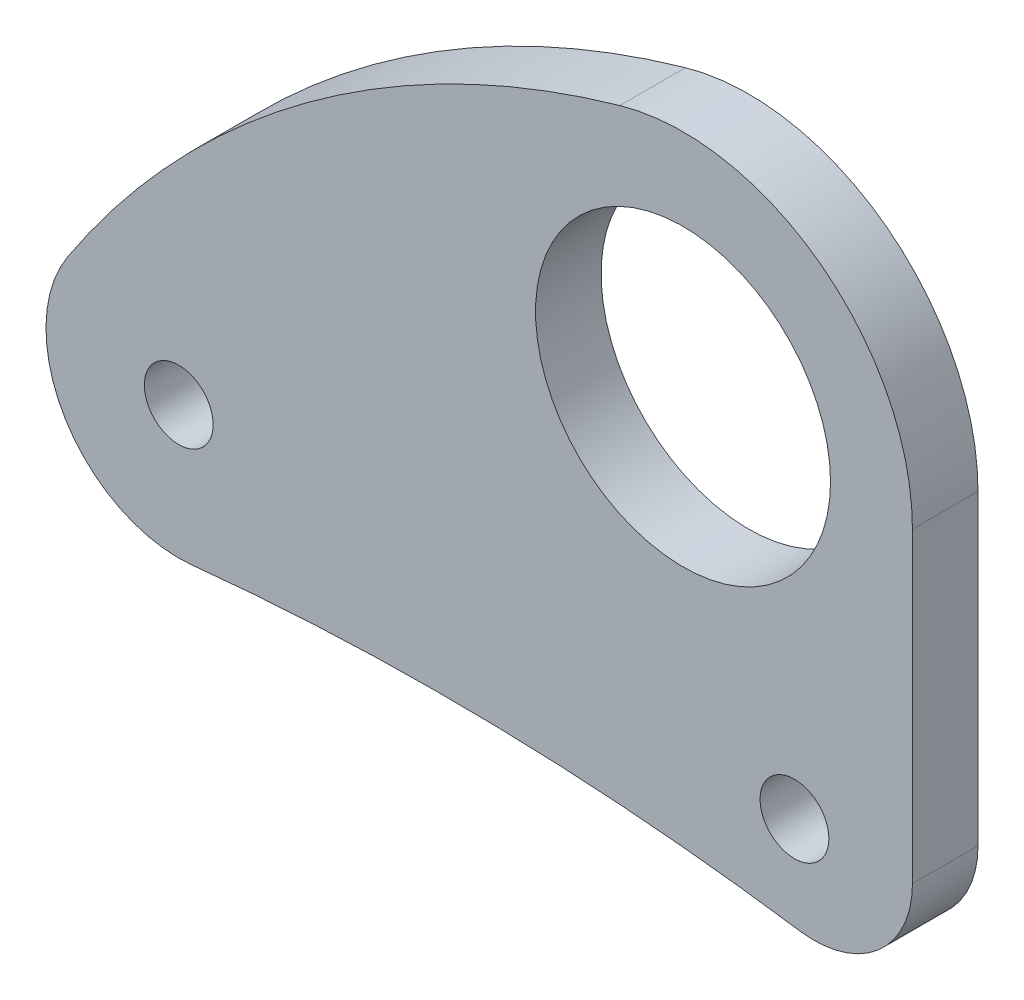
ISO-10303-21;
HEADER;
FILE_DESCRIPTION(('STEP AP214'),'2;1');
FILE_NAME('part.step','',(''),(''),'','','');
FILE_SCHEMA(('AUTOMOTIVE_DESIGN { 1 0 10303 214 1 1 1 1 }'));
ENDSEC;
DATA;
#1=APPLICATION_CONTEXT('core data for automotive mechanical design processes');
#2=APPLICATION_PROTOCOL_DEFINITION('international standard','automotive_design',2000,#1);
#3=PRODUCT_CONTEXT('',#1,'mechanical');
#4=PRODUCT('Part','Part','',(#3));
#5=PRODUCT_RELATED_PRODUCT_CATEGORY('part','',(#4));
#6=PRODUCT_DEFINITION_FORMATION('','',#4);
#7=PRODUCT_DEFINITION_CONTEXT('part definition',#1,'design');
#8=PRODUCT_DEFINITION('design','',#6,#7);
#9=PRODUCT_DEFINITION_SHAPE('','',#8);
#10=(LENGTH_UNIT() NAMED_UNIT(*) SI_UNIT(.MILLI.,.METRE.));
#11=(NAMED_UNIT(*) PLANE_ANGLE_UNIT() SI_UNIT($,.RADIAN.));
#12=(NAMED_UNIT(*) SI_UNIT($,.STERADIAN.) SOLID_ANGLE_UNIT());
#13=UNCERTAINTY_MEASURE_WITH_UNIT(LENGTH_MEASURE(1.E-05),#10,'distance_accuracy_value','');
#14=(GEOMETRIC_REPRESENTATION_CONTEXT(3) GLOBAL_UNCERTAINTY_ASSIGNED_CONTEXT((#13)) GLOBAL_UNIT_ASSIGNED_CONTEXT((#10,
#11,#12)) REPRESENTATION_CONTEXT('',''));
#15=CARTESIAN_POINT('',(0.,0.,0.));
#16=DIRECTION('',(0.,0.,1.));
#17=DIRECTION('',(1.,0.,0.));
#18=AXIS2_PLACEMENT_3D('',#15,#16,#17);
#19=CARTESIAN_POINT('',(0.,0.,4.));
#20=DIRECTION('',(0.,0.,1.));
#21=DIRECTION('',(1.,0.,0.));
#22=AXIS2_PLACEMENT_3D('',#19,#20,#21);
#23=PLANE('',#22);
#24=CARTESIAN_POINT('',(6.8,-18.9148090130458,4.));
#25=DIRECTION('',(0.,0.,1.));
#26=DIRECTION('',(1.,0.,0.));
#27=AXIS2_PLACEMENT_3D('',#24,#25,#26);
#28=CIRCLE('',#27,2.1);
#29=CARTESIAN_POINT('',(8.9,-18.9148090130458,4.));
#30=VERTEX_POINT('',#29);
#31=EDGE_CURVE('E188',#30,#30,#28,.T.);
#32=ORIENTED_EDGE('',*,*,#31,.F.);
#33=EDGE_LOOP('',(#32));
#34=FACE_BOUND('',#33,.T.);
#35=CARTESIAN_POINT('',(0.,0.,4.));
#36=DIRECTION('',(0.,0.,1.));
#37=DIRECTION('',(1.,0.,0.));
#38=AXIS2_PLACEMENT_3D('',#35,#36,#37);
#39=CIRCLE('',#38,14.);
#40=CARTESIAN_POINT('',(14.,0.,4.));
#41=VERTEX_POINT('',#40);
#42=CARTESIAN_POINT('',(-3.85451366304862,13.4589273131766,4.));
#43=VERTEX_POINT('',#42);
#44=EDGE_CURVE('E133',#41,#43,#39,.T.);
#45=ORIENTED_EDGE('',*,*,#44,.T.);
#46=CARTESIAN_POINT('',(12.6648306071598,-44.2221897432946,4.));
#47=DIRECTION('',(0.,0.,1.));
#48=DIRECTION('',(1.,0.,0.));
#49=AXIS2_PLACEMENT_3D('',#46,#47,#48);
#50=CIRCLE('',#49,60.);
#51=CARTESIAN_POINT('',(-37.5518403068304,-11.3849249011063,4.));
#52=VERTEX_POINT('',#51);
#53=EDGE_CURVE('E91',#43,#52,#50,.T.);
#54=ORIENTED_EDGE('',*,*,#53,.T.);
#55=CARTESIAN_POINT('',(-30.7725897334418,-15.8179556548018,4.));
#56=DIRECTION('',(0.,0.,1.));
#57=DIRECTION('',(1.,0.,0.));
#58=AXIS2_PLACEMENT_3D('',#55,#56,#57);
#59=CIRCLE('',#58,8.1);
#60=CARTESIAN_POINT('',(-29.9442973212136,-23.8754944651237,4.));
#61=VERTEX_POINT('',#60);
#62=EDGE_CURVE('E104',#52,#61,#59,.T.);
#63=ORIENTED_EDGE('',*,*,#62,.T.);
#64=CARTESIAN_POINT('',(-14.6055489466185,-173.089176137753,4.));
#65=DIRECTION('',(0.,0.,-1.));
#66=DIRECTION('',(-1.,0.,0.));
#67=AXIS2_PLACEMENT_3D('',#64,#65,#66);
#68=CIRCLE('',#67,150.);
#69=CARTESIAN_POINT('',(7.13055580974545,-24.6723922148413,4.));
#70=VERTEX_POINT('',#69);
#71=EDGE_CURVE('E98',#61,#70,#68,.T.);
#72=ORIENTED_EDGE('',*,*,#71,.T.);
#73=CARTESIAN_POINT('',(8.,-18.7357208579248,4.));
#74=DIRECTION('',(0.,0.,1.));
#75=DIRECTION('',(-1.,0.,0.));
#76=AXIS2_PLACEMENT_3D('',#73,#74,#75);
#77=CIRCLE('',#76,5.99999999999999);
#78=CARTESIAN_POINT('',(14.,-18.7357208579248,4.));
#79=VERTEX_POINT('',#78);
#80=EDGE_CURVE('E102',#70,#79,#77,.T.);
#81=ORIENTED_EDGE('',*,*,#80,.T.);
#82=DIRECTION('',(0.,1.,0.));
#83=VECTOR('',#82,1.);
#84=CARTESIAN_POINT('',(14.,0.,4.));
#85=LINE('',#84,#83);
#86=EDGE_CURVE('E54',#79,#41,#85,.T.);
#87=ORIENTED_EDGE('',*,*,#86,.T.);
#88=EDGE_LOOP('',(#45,#54,#63,#72,#81,#87));
#89=FACE_BOUND('',#88,.T.);
#90=CARTESIAN_POINT('',(0.,0.,4.));
#91=DIRECTION('',(0.,0.,1.));
#92=DIRECTION('',(1.,0.,0.));
#93=AXIS2_PLACEMENT_3D('',#90,#91,#92);
#94=CIRCLE('',#93,9.);
#95=CARTESIAN_POINT('',(9.,0.,4.));
#96=VERTEX_POINT('',#95);
#97=EDGE_CURVE('E126',#96,#96,#94,.T.);
#98=ORIENTED_EDGE('',*,*,#97,.F.);
#99=EDGE_LOOP('',(#98));
#100=FACE_BOUND('',#99,.T.);
#101=CARTESIAN_POINT('',(-30.7725897334418,-15.8179556548018,4.));
#102=DIRECTION('',(0.,0.,1.));
#103=DIRECTION('',(1.,0.,0.));
#104=AXIS2_PLACEMENT_3D('',#101,#102,#103);
#105=CIRCLE('',#104,2.1);
#106=CARTESIAN_POINT('',(-28.6725897334418,-15.8179556548018,4.));
#107=VERTEX_POINT('',#106);
#108=EDGE_CURVE('E179',#107,#107,#105,.T.);
#109=ORIENTED_EDGE('',*,*,#108,.F.);
#110=EDGE_LOOP('',(#109));
#111=FACE_BOUND('',#110,.T.);
#112=ADVANCED_FACE('F37',(#34,#89,#100,#111),#23,.T.);
#113=CARTESIAN_POINT('',(0.,0.,0.));
#114=DIRECTION('',(0.,0.,1.));
#115=DIRECTION('',(1.,0.,0.));
#116=AXIS2_PLACEMENT_3D('',#113,#114,#115);
#117=PLANE('',#116);
#118=CARTESIAN_POINT('',(0.,0.,0.));
#119=DIRECTION('',(0.,0.,1.));
#120=DIRECTION('',(1.,0.,0.));
#121=AXIS2_PLACEMENT_3D('',#118,#119,#120);
#122=CIRCLE('',#121,14.);
#123=CARTESIAN_POINT('',(14.,0.,0.));
#124=VERTEX_POINT('',#123);
#125=CARTESIAN_POINT('',(-3.85451366304862,13.4589273131766,0.));
#126=VERTEX_POINT('',#125);
#127=EDGE_CURVE('E122',#124,#126,#122,.T.);
#128=ORIENTED_EDGE('',*,*,#127,.F.);
#129=DIRECTION('',(0.,1.,0.));
#130=VECTOR('',#129,1.);
#131=CARTESIAN_POINT('',(14.,0.,0.));
#132=LINE('',#131,#130);
#133=CARTESIAN_POINT('',(14.,-18.7357208579248,0.));
#134=VERTEX_POINT('',#133);
#135=EDGE_CURVE('E83',#134,#124,#132,.T.);
#136=ORIENTED_EDGE('',*,*,#135,.F.);
#137=CARTESIAN_POINT('',(8.,-18.7357208579248,0.));
#138=DIRECTION('',(0.,0.,1.));
#139=DIRECTION('',(-1.,0.,0.));
#140=AXIS2_PLACEMENT_3D('',#137,#138,#139);
#141=CIRCLE('',#140,5.99999999999999);
#142=CARTESIAN_POINT('',(7.13055580974545,-24.6723922148413,0.));
#143=VERTEX_POINT('',#142);
#144=EDGE_CURVE('E77',#143,#134,#141,.T.);
#145=ORIENTED_EDGE('',*,*,#144,.F.);
#146=CARTESIAN_POINT('',(-14.6055489466185,-173.089176137753,0.));
#147=DIRECTION('',(0.,0.,-1.));
#148=DIRECTION('',(-1.,0.,0.));
#149=AXIS2_PLACEMENT_3D('',#146,#147,#148);
#150=CIRCLE('',#149,150.);
#151=CARTESIAN_POINT('',(-29.9442973212136,-23.8754944651237,0.));
#152=VERTEX_POINT('',#151);
#153=EDGE_CURVE('E112',#152,#143,#150,.T.);
#154=ORIENTED_EDGE('',*,*,#153,.F.);
#155=CARTESIAN_POINT('',(-30.7725897334418,-15.8179556548018,0.));
#156=DIRECTION('',(0.,0.,1.));
#157=DIRECTION('',(1.,0.,0.));
#158=AXIS2_PLACEMENT_3D('',#155,#156,#157);
#159=CIRCLE('',#158,8.1);
#160=CARTESIAN_POINT('',(-37.5518403068304,-11.3849249011063,0.));
#161=VERTEX_POINT('',#160);
#162=EDGE_CURVE('E128',#161,#152,#159,.T.);
#163=ORIENTED_EDGE('',*,*,#162,.F.);
#164=CARTESIAN_POINT('',(12.6648306071598,-44.2221897432946,0.));
#165=DIRECTION('',(0.,0.,1.));
#166=DIRECTION('',(1.,0.,0.));
#167=AXIS2_PLACEMENT_3D('',#164,#165,#166);
#168=CIRCLE('',#167,60.);
#169=EDGE_CURVE('E125',#126,#161,#168,.T.);
#170=ORIENTED_EDGE('',*,*,#169,.F.);
#171=EDGE_LOOP('',(#128,#136,#145,#154,#163,#170));
#172=FACE_BOUND('',#171,.T.);
#173=CARTESIAN_POINT('',(0.,0.,0.));
#174=DIRECTION('',(0.,0.,1.));
#175=DIRECTION('',(1.,0.,0.));
#176=AXIS2_PLACEMENT_3D('',#173,#174,#175);
#177=CIRCLE('',#176,9.);
#178=CARTESIAN_POINT('',(9.,0.,0.));
#179=VERTEX_POINT('',#178);
#180=EDGE_CURVE('E191',#179,#179,#177,.T.);
#181=ORIENTED_EDGE('',*,*,#180,.T.);
#182=EDGE_LOOP('',(#181));
#183=FACE_BOUND('',#182,.T.);
#184=CARTESIAN_POINT('',(6.8,-18.9148090130458,0.));
#185=DIRECTION('',(0.,0.,1.));
#186=DIRECTION('',(1.,0.,0.));
#187=AXIS2_PLACEMENT_3D('',#184,#185,#186);
#188=CIRCLE('',#187,2.1);
#189=CARTESIAN_POINT('',(8.9,-18.9148090130458,0.));
#190=VERTEX_POINT('',#189);
#191=EDGE_CURVE('E185',#190,#190,#188,.T.);
#192=ORIENTED_EDGE('',*,*,#191,.T.);
#193=EDGE_LOOP('',(#192));
#194=FACE_BOUND('',#193,.T.);
#195=CARTESIAN_POINT('',(-30.7725897334418,-15.8179556548018,0.));
#196=DIRECTION('',(0.,0.,1.));
#197=DIRECTION('',(1.,0.,0.));
#198=AXIS2_PLACEMENT_3D('',#195,#196,#197);
#199=CIRCLE('',#198,2.1);
#200=CARTESIAN_POINT('',(-28.6725897334418,-15.8179556548018,0.));
#201=VERTEX_POINT('',#200);
#202=EDGE_CURVE('E182',#201,#201,#199,.T.);
#203=ORIENTED_EDGE('',*,*,#202,.T.);
#204=EDGE_LOOP('',(#203));
#205=FACE_BOUND('',#204,.T.);
#206=ADVANCED_FACE('F142',(#172,#183,#194,#205),#117,.F.);
#207=CARTESIAN_POINT('',(0.,0.,4.));
#208=DIRECTION('',(0.,0.,-1.));
#209=DIRECTION('',(-1.,0.,0.));
#210=AXIS2_PLACEMENT_3D('',#207,#208,#209);
#211=CYLINDRICAL_SURFACE('',#210,14.);
#212=ORIENTED_EDGE('',*,*,#127,.T.);
#213=DIRECTION('',(0.,0.,-1.));
#214=VECTOR('',#213,1.);
#215=CARTESIAN_POINT('',(-3.85451366304862,13.4589273131766,4.));
#216=LINE('',#215,#214);
#217=EDGE_CURVE('E11',#43,#126,#216,.T.);
#218=ORIENTED_EDGE('',*,*,#217,.F.);
#219=ORIENTED_EDGE('',*,*,#44,.F.);
#220=DIRECTION('',(0.,0.,-1.));
#221=VECTOR('',#220,1.);
#222=CARTESIAN_POINT('',(14.,0.,4.));
#223=LINE('',#222,#221);
#224=EDGE_CURVE('E118',#41,#124,#223,.T.);
#225=ORIENTED_EDGE('',*,*,#224,.T.);
#226=EDGE_LOOP('',(#212,#218,#219,#225));
#227=FACE_BOUND('',#226,.T.);
#228=ADVANCED_FACE('F39',(#227),#211,.T.);
#229=CARTESIAN_POINT('',(12.6648306071598,-44.2221897432946,4.));
#230=DIRECTION('',(0.,0.,-1.));
#231=DIRECTION('',(-1.,0.,0.));
#232=AXIS2_PLACEMENT_3D('',#229,#230,#231);
#233=CYLINDRICAL_SURFACE('',#232,60.);
#234=ORIENTED_EDGE('',*,*,#169,.T.);
#235=DIRECTION('',(0.,0.,-1.));
#236=VECTOR('',#235,1.);
#237=CARTESIAN_POINT('',(-37.5518403068304,-11.3849249011063,4.));
#238=LINE('',#237,#236);
#239=EDGE_CURVE('E46',#52,#161,#238,.T.);
#240=ORIENTED_EDGE('',*,*,#239,.F.);
#241=ORIENTED_EDGE('',*,*,#53,.F.);
#242=ORIENTED_EDGE('',*,*,#217,.T.);
#243=EDGE_LOOP('',(#234,#240,#241,#242));
#244=FACE_BOUND('',#243,.T.);
#245=ADVANCED_FACE('F241',(#244),#233,.T.);
#246=CARTESIAN_POINT('',(-30.7725897334418,-15.8179556548018,4.));
#247=DIRECTION('',(0.,0.,-1.));
#248=DIRECTION('',(-1.,0.,0.));
#249=AXIS2_PLACEMENT_3D('',#246,#247,#248);
#250=CYLINDRICAL_SURFACE('',#249,8.1);
#251=ORIENTED_EDGE('',*,*,#162,.T.);
#252=DIRECTION('',(0.,0.,-1.));
#253=VECTOR('',#252,1.);
#254=CARTESIAN_POINT('',(-29.9442973212136,-23.8754944651237,4.));
#255=LINE('',#254,#253);
#256=EDGE_CURVE('E113',#61,#152,#255,.T.);
#257=ORIENTED_EDGE('',*,*,#256,.F.);
#258=ORIENTED_EDGE('',*,*,#62,.F.);
#259=ORIENTED_EDGE('',*,*,#239,.T.);
#260=EDGE_LOOP('',(#251,#257,#258,#259));
#261=FACE_BOUND('',#260,.T.);
#262=ADVANCED_FACE('F139',(#261),#250,.T.);
#263=CARTESIAN_POINT('',(-14.6055489466185,-173.089176137753,4.));
#264=DIRECTION('',(0.,0.,-1.));
#265=DIRECTION('',(-1.,0.,0.));
#266=AXIS2_PLACEMENT_3D('',#263,#264,#265);
#267=CYLINDRICAL_SURFACE('',#266,150.);
#268=ORIENTED_EDGE('',*,*,#153,.T.);
#269=DIRECTION('',(0.,0.,-1.));
#270=VECTOR('',#269,1.);
#271=CARTESIAN_POINT('',(7.13055580974545,-24.6723922148413,4.));
#272=LINE('',#271,#270);
#273=EDGE_CURVE('E109',#70,#143,#272,.T.);
#274=ORIENTED_EDGE('',*,*,#273,.F.);
#275=ORIENTED_EDGE('',*,*,#71,.F.);
#276=ORIENTED_EDGE('',*,*,#256,.T.);
#277=EDGE_LOOP('',(#268,#274,#275,#276));
#278=FACE_BOUND('',#277,.T.);
#279=ADVANCED_FACE('F110',(#278),#267,.F.);
#280=CARTESIAN_POINT('',(8.,-18.7357208579248,4.));
#281=DIRECTION('',(0.,0.,-1.));
#282=DIRECTION('',(-1.,0.,0.));
#283=AXIS2_PLACEMENT_3D('',#280,#281,#282);
#284=CYLINDRICAL_SURFACE('',#283,5.99999999999999);
#285=ORIENTED_EDGE('',*,*,#144,.T.);
#286=DIRECTION('',(0.,0.,-1.));
#287=VECTOR('',#286,1.);
#288=CARTESIAN_POINT('',(14.,-18.7357208579248,4.));
#289=LINE('',#288,#287);
#290=EDGE_CURVE('E114',#79,#134,#289,.T.);
#291=ORIENTED_EDGE('',*,*,#290,.F.);
#292=ORIENTED_EDGE('',*,*,#80,.F.);
#293=ORIENTED_EDGE('',*,*,#273,.T.);
#294=EDGE_LOOP('',(#285,#291,#292,#293));
#295=FACE_BOUND('',#294,.T.);
#296=ADVANCED_FACE('F116',(#295),#284,.T.);
#297=CARTESIAN_POINT('',(14.,0.,4.));
#298=DIRECTION('',(-1.,0.,0.));
#299=DIRECTION('',(0.,0.,1.));
#300=AXIS2_PLACEMENT_3D('',#297,#298,#299);
#301=PLANE('',#300);
#302=ORIENTED_EDGE('',*,*,#135,.T.);
#303=ORIENTED_EDGE('',*,*,#224,.F.);
#304=ORIENTED_EDGE('',*,*,#86,.F.);
#305=ORIENTED_EDGE('',*,*,#290,.T.);
#306=EDGE_LOOP('',(#302,#303,#304,#305));
#307=FACE_BOUND('',#306,.T.);
#308=ADVANCED_FACE('F147',(#307),#301,.F.);
#309=CARTESIAN_POINT('',(0.,0.,4.));
#310=DIRECTION('',(0.,0.,-1.));
#311=DIRECTION('',(-1.,0.,0.));
#312=AXIS2_PLACEMENT_3D('',#309,#310,#311);
#313=CYLINDRICAL_SURFACE('',#312,9.);
#314=ORIENTED_EDGE('',*,*,#97,.T.);
#315=EDGE_LOOP('',(#314));
#316=FACE_BOUND('',#315,.T.);
#317=ORIENTED_EDGE('',*,*,#180,.F.);
#318=EDGE_LOOP('',(#317));
#319=FACE_BOUND('',#318,.T.);
#320=ADVANCED_FACE('F149',(#316,#319),#313,.F.);
#321=CARTESIAN_POINT('',(6.8,-18.9148090130458,4.));
#322=DIRECTION('',(0.,0.,-1.));
#323=DIRECTION('',(-1.,0.,0.));
#324=AXIS2_PLACEMENT_3D('',#321,#322,#323);
#325=CYLINDRICAL_SURFACE('',#324,2.1);
#326=ORIENTED_EDGE('',*,*,#31,.T.);
#327=EDGE_LOOP('',(#326));
#328=FACE_BOUND('',#327,.T.);
#329=ORIENTED_EDGE('',*,*,#191,.F.);
#330=EDGE_LOOP('',(#329));
#331=FACE_BOUND('',#330,.T.);
#332=ADVANCED_FACE('F155',(#328,#331),#325,.F.);
#333=CARTESIAN_POINT('',(-30.7725897334418,-15.8179556548018,4.));
#334=DIRECTION('',(0.,0.,-1.));
#335=DIRECTION('',(-1.,0.,0.));
#336=AXIS2_PLACEMENT_3D('',#333,#334,#335);
#337=CYLINDRICAL_SURFACE('',#336,2.1);
#338=ORIENTED_EDGE('',*,*,#108,.T.);
#339=EDGE_LOOP('',(#338));
#340=FACE_BOUND('',#339,.T.);
#341=ORIENTED_EDGE('',*,*,#202,.F.);
#342=EDGE_LOOP('',(#341));
#343=FACE_BOUND('',#342,.T.);
#344=ADVANCED_FACE('F170',(#340,#343),#337,.F.);
#345=CLOSED_SHELL('',(#112,#206,#228,#245,#262,#279,#296,#308,#320,#332,#344));
#346=MANIFOLD_SOLID_BREP('B2',#345);
#347=ADVANCED_BREP_SHAPE_REPRESENTATION('',(#18,#346),#14);
#348=SHAPE_DEFINITION_REPRESENTATION(#9,#347);
ENDSEC;
END-ISO-10303-21;
